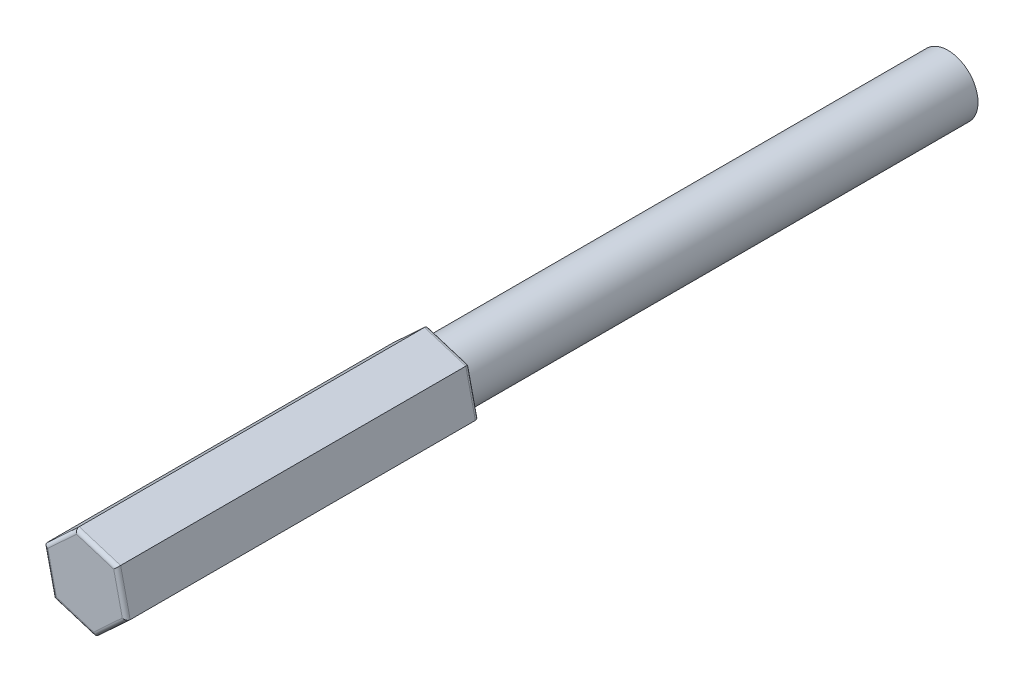
ISO-10303-21;
HEADER;
FILE_DESCRIPTION(('STEP AP214'),'2;1');
FILE_NAME('part.step','',(''),(''),'','','');
FILE_SCHEMA(('AUTOMOTIVE_DESIGN { 1 0 10303 214 1 1 1 1 }'));
ENDSEC;
DATA;
#1=APPLICATION_CONTEXT('core data for automotive mechanical design processes');
#2=APPLICATION_PROTOCOL_DEFINITION('international standard','automotive_design',2000,#1);
#3=PRODUCT_CONTEXT('',#1,'mechanical');
#4=PRODUCT('Part','Part','',(#3));
#5=PRODUCT_RELATED_PRODUCT_CATEGORY('part','',(#4));
#6=PRODUCT_DEFINITION_FORMATION('','',#4);
#7=PRODUCT_DEFINITION_CONTEXT('part definition',#1,'design');
#8=PRODUCT_DEFINITION('design','',#6,#7);
#9=PRODUCT_DEFINITION_SHAPE('','',#8);
#10=(LENGTH_UNIT() NAMED_UNIT(*) SI_UNIT(.MILLI.,.METRE.));
#11=(NAMED_UNIT(*) PLANE_ANGLE_UNIT() SI_UNIT($,.RADIAN.));
#12=(NAMED_UNIT(*) SI_UNIT($,.STERADIAN.) SOLID_ANGLE_UNIT());
#13=UNCERTAINTY_MEASURE_WITH_UNIT(LENGTH_MEASURE(1.E-05),#10,'distance_accuracy_value','');
#14=(GEOMETRIC_REPRESENTATION_CONTEXT(3) GLOBAL_UNCERTAINTY_ASSIGNED_CONTEXT((#13)) GLOBAL_UNIT_ASSIGNED_CONTEXT((#10,
#11,#12)) REPRESENTATION_CONTEXT('',''));
#15=CARTESIAN_POINT('',(0.,0.,0.));
#16=DIRECTION('',(0.,0.,1.));
#17=DIRECTION('',(1.,0.,0.));
#18=AXIS2_PLACEMENT_3D('',#15,#16,#17);
#19=CARTESIAN_POINT('',(0.,0.,38.));
#20=DIRECTION('',(0.,0.,1.));
#21=DIRECTION('',(1.,0.,0.));
#22=AXIS2_PLACEMENT_3D('',#19,#20,#21);
#23=PLANE('',#22);
#24=DIRECTION('',(-0.954937695990961,0.296806328732181,0.));
#25=VECTOR('',#24,1.);
#26=CARTESIAN_POINT('',(4.09229615849332,3.44041356300578,38.));
#27=LINE('',#26,#25);
#28=CARTESIAN_POINT('',(1.33562847929482,4.29721963195933,38.));
#29=VERTEX_POINT('',#28);
#30=CARTESIAN_POINT('',(3.81662939057347,3.52609416990113,38.));
#31=VERTEX_POINT('',#30);
#32=EDGE_CURVE('E50',#29,#31,#27,.F.);
#33=ORIENTED_EDGE('',*,*,#32,.T.);
#34=DIRECTION('',(-0.220427027309416,0.975403468125644,0.));
#35=VECTOR('',#34,1.);
#36=CARTESIAN_POINT('',(5.0256336243342,-1.8238256515618,38.));
#37=LINE('',#36,#35);
#38=CARTESIAN_POINT('',(4.3893156065654,0.991921622892373,38.));
#39=VERTEX_POINT('',#38);
#40=EDGE_CURVE('E42',#31,#39,#37,.F.);
#41=ORIENTED_EDGE('',*,*,#40,.T.);
#42=CARTESIAN_POINT('',(0.,0.,38.));
#43=DIRECTION('',(0.,0.,1.));
#44=DIRECTION('',(1.,0.,0.));
#45=AXIS2_PLACEMENT_3D('',#42,#43,#44);
#46=CIRCLE('',#45,4.5);
#47=EDGE_CURVE('E216',#39,#29,#46,.T.);
#48=ORIENTED_EDGE('',*,*,#47,.T.);
#49=EDGE_LOOP('',(#33,#41,#48));
#50=FACE_BOUND('',#49,.T.);
#51=ADVANCED_FACE('F33',(#50),#23,.F.);
#52=DIRECTION('',(-0.734510668681544,-0.678597139393463,0.));
#53=VECTOR('',#52,1.);
#54=CARTESIAN_POINT('',(-0.933337465840873,5.26423921456758,38.));
#55=LINE('',#54,#53);
#56=CARTESIAN_POINT('',(-3.05368712727058,3.30529800906695,38.));
#57=VERTEX_POINT('',#56);
#58=CARTESIAN_POINT('',(-1.14537243198384,5.06834509401752,38.));
#59=VERTEX_POINT('',#58);
#60=EDGE_CURVE('E58',#57,#59,#55,.F.);
#61=ORIENTED_EDGE('',*,*,#60,.T.);
#62=DIRECTION('',(-0.954937695990961,0.296806328732181,0.));
#63=VECTOR('',#62,1.);
#64=CARTESIAN_POINT('',(4.09229615849332,3.44041356300578,38.));
#65=LINE('',#64,#63);
#66=EDGE_CURVE('E238',#59,#29,#65,.F.);
#67=ORIENTED_EDGE('',*,*,#66,.T.);
#68=CARTESIAN_POINT('',(0.,0.,38.));
#69=DIRECTION('',(0.,0.,1.));
#70=DIRECTION('',(1.,0.,0.));
#71=AXIS2_PLACEMENT_3D('',#68,#69,#70);
#72=CIRCLE('',#71,4.5);
#73=EDGE_CURVE('E214',#29,#57,#72,.T.);
#74=ORIENTED_EDGE('',*,*,#73,.T.);
#75=EDGE_LOOP('',(#61,#67,#74));
#76=FACE_BOUND('',#75,.T.);
#77=ADVANCED_FACE('F370',(#76),#23,.F.);
#78=DIRECTION('',(0.220427027309417,-0.975403468125644,0.));
#79=VECTOR('',#78,1.);
#80=CARTESIAN_POINT('',(-5.0256336243342,1.8238256515618,38.));
#81=LINE('',#80,#79);
#82=CARTESIAN_POINT('',(-4.3893156065654,-0.991921622892375,38.));
#83=VERTEX_POINT('',#82);
#84=CARTESIAN_POINT('',(-4.96200182255732,1.54225092411638,38.));
#85=VERTEX_POINT('',#84);
#86=EDGE_CURVE('E233',#83,#85,#81,.F.);
#87=ORIENTED_EDGE('',*,*,#86,.T.);
#88=DIRECTION('',(-0.734510668681544,-0.678597139393463,0.));
#89=VECTOR('',#88,1.);
#90=CARTESIAN_POINT('',(-0.933337465840873,5.26423921456758,38.));
#91=LINE('',#90,#89);
#92=EDGE_CURVE('E235',#85,#57,#91,.F.);
#93=ORIENTED_EDGE('',*,*,#92,.T.);
#94=CARTESIAN_POINT('',(0.,0.,38.));
#95=DIRECTION('',(0.,0.,1.));
#96=DIRECTION('',(1.,0.,0.));
#97=AXIS2_PLACEMENT_3D('',#94,#95,#96);
#98=CIRCLE('',#97,4.5);
#99=EDGE_CURVE('E211',#57,#83,#98,.T.);
#100=ORIENTED_EDGE('',*,*,#99,.T.);
#101=EDGE_LOOP('',(#87,#93,#100));
#102=FACE_BOUND('',#101,.T.);
#103=ADVANCED_FACE('F289',(#102),#23,.F.);
#104=DIRECTION('',(0.954937695990961,-0.296806328732181,0.));
#105=VECTOR('',#104,1.);
#106=CARTESIAN_POINT('',(-4.09229615849333,-3.44041356300578,38.));
#107=LINE('',#106,#105);
#108=CARTESIAN_POINT('',(-1.33562847929482,-4.29721963195932,38.));
#109=VERTEX_POINT('',#108);
#110=CARTESIAN_POINT('',(-3.81662939057347,-3.52609416990113,38.));
#111=VERTEX_POINT('',#110);
#112=EDGE_CURVE('E229',#109,#111,#107,.F.);
#113=ORIENTED_EDGE('',*,*,#112,.T.);
#114=DIRECTION('',(0.220427027309417,-0.975403468125644,0.));
#115=VECTOR('',#114,1.);
#116=CARTESIAN_POINT('',(-5.0256336243342,1.8238256515618,38.));
#117=LINE('',#116,#115);
#118=EDGE_CURVE('E231',#111,#83,#117,.F.);
#119=ORIENTED_EDGE('',*,*,#118,.T.);
#120=CARTESIAN_POINT('',(0.,0.,38.));
#121=DIRECTION('',(0.,0.,1.));
#122=DIRECTION('',(1.,0.,0.));
#123=AXIS2_PLACEMENT_3D('',#120,#121,#122);
#124=CIRCLE('',#123,4.5);
#125=EDGE_CURVE('E208',#83,#109,#124,.T.);
#126=ORIENTED_EDGE('',*,*,#125,.T.);
#127=EDGE_LOOP('',(#113,#119,#126));
#128=FACE_BOUND('',#127,.T.);
#129=ADVANCED_FACE('F286',(#128),#23,.F.);
#130=DIRECTION('',(0.734510668681544,0.678597139393463,0.));
#131=VECTOR('',#130,1.);
#132=CARTESIAN_POINT('',(0.933337465840874,-5.26423921456758,38.));
#133=LINE('',#132,#131);
#134=CARTESIAN_POINT('',(3.05368712727058,-3.30529800906695,38.));
#135=VERTEX_POINT('',#134);
#136=CARTESIAN_POINT('',(1.14537243198385,-5.06834509401752,38.));
#137=VERTEX_POINT('',#136);
#138=EDGE_CURVE('E225',#135,#137,#133,.F.);
#139=ORIENTED_EDGE('',*,*,#138,.T.);
#140=DIRECTION('',(0.954937695990961,-0.296806328732181,0.));
#141=VECTOR('',#140,1.);
#142=CARTESIAN_POINT('',(-4.09229615849333,-3.44041356300578,38.));
#143=LINE('',#142,#141);
#144=EDGE_CURVE('E227',#137,#109,#143,.F.);
#145=ORIENTED_EDGE('',*,*,#144,.T.);
#146=CARTESIAN_POINT('',(0.,0.,38.));
#147=DIRECTION('',(0.,0.,1.));
#148=DIRECTION('',(1.,0.,0.));
#149=AXIS2_PLACEMENT_3D('',#146,#147,#148);
#150=CIRCLE('',#149,4.5);
#151=EDGE_CURVE('E205',#109,#135,#150,.T.);
#152=ORIENTED_EDGE('',*,*,#151,.T.);
#153=EDGE_LOOP('',(#139,#145,#152));
#154=FACE_BOUND('',#153,.T.);
#155=ADVANCED_FACE('F297',(#154),#23,.F.);
#156=CARTESIAN_POINT('',(0.,0.,-30.));
#157=DIRECTION('',(0.,0.,1.));
#158=DIRECTION('',(1.,0.,0.));
#159=AXIS2_PLACEMENT_3D('',#156,#157,#158);
#160=CYLINDRICAL_SURFACE('',#159,4.);
#161=CARTESIAN_POINT('',(0.,0.,37.5));
#162=DIRECTION('',(0.,0.,1.));
#163=DIRECTION('',(1.,0.,0.));
#164=AXIS2_PLACEMENT_3D('',#161,#162,#163);
#165=CIRCLE('',#164,4.);
#166=CARTESIAN_POINT('',(4.,0.,37.5));
#167=VERTEX_POINT('',#166);
#168=EDGE_CURVE('E11',#167,#167,#165,.F.);
#169=ORIENTED_EDGE('',*,*,#168,.T.);
#170=EDGE_LOOP('',(#169));
#171=FACE_BOUND('',#170,.T.);
#172=CARTESIAN_POINT('',(0.,0.,-30.));
#173=DIRECTION('',(0.,0.,1.));
#174=DIRECTION('',(1.,0.,0.));
#175=AXIS2_PLACEMENT_3D('',#172,#173,#174);
#176=CIRCLE('',#175,4.);
#177=CARTESIAN_POINT('',(4.,0.,-30.));
#178=VERTEX_POINT('',#177);
#179=EDGE_CURVE('E168',#178,#178,#176,.T.);
#180=ORIENTED_EDGE('',*,*,#179,.T.);
#181=EDGE_LOOP('',(#180));
#182=FACE_BOUND('',#181,.T.);
#183=ADVANCED_FACE('F386',(#171,#182),#160,.T.);
#184=CARTESIAN_POINT('',(0.,0.,-30.));
#185=DIRECTION('',(0.,0.,1.));
#186=DIRECTION('',(1.,0.,0.));
#187=AXIS2_PLACEMENT_3D('',#184,#185,#186);
#188=PLANE('',#187);
#189=ORIENTED_EDGE('',*,*,#179,.F.);
#190=EDGE_LOOP('',(#189));
#191=FACE_BOUND('',#190,.T.);
#192=ADVANCED_FACE('F391',(#191),#188,.F.);
#193=CARTESIAN_POINT('',(1.27263603553761,-5.63149454890835,38.));
#194=DIRECTION('',(0.678597139393463,-0.734510668681544,0.));
#195=DIRECTION('',(0.734510668681544,0.678597139393463,0.));
#196=AXIS2_PLACEMENT_3D('',#193,#194,#195);
#197=PLANE('',#196);
#198=DIRECTION('',(0.,0.,1.));
#199=VECTOR('',#198,1.);
#200=CARTESIAN_POINT('',(5.51333535839702,-1.71361213790709,38.));
#201=LINE('',#200,#199);
#202=CARTESIAN_POINT('',(5.51333535839702,-1.71361213790709,38.5));
#203=VERTEX_POINT('',#202);
#204=CARTESIAN_POINT('',(5.51333535839702,-1.71361213790709,84.5));
#205=VERTEX_POINT('',#204);
#206=EDGE_CURVE('E253',#203,#205,#201,.T.);
#207=ORIENTED_EDGE('',*,*,#206,.T.);
#208=DIRECTION('',(0.734510668681544,0.678597139393463,0.));
#209=VECTOR('',#208,1.);
#210=CARTESIAN_POINT('',(1.27263603553761,-5.63149454890835,84.5));
#211=LINE('',#210,#209);
#212=CARTESIAN_POINT('',(1.27263603553761,-5.63149454890835,84.5));
#213=VERTEX_POINT('',#212);
#214=EDGE_CURVE('E201',#205,#213,#211,.F.);
#215=ORIENTED_EDGE('',*,*,#214,.T.);
#216=DIRECTION('',(0.,0.,1.));
#217=VECTOR('',#216,1.);
#218=CARTESIAN_POINT('',(1.27263603553761,-5.63149454890835,38.));
#219=LINE('',#218,#217);
#220=CARTESIAN_POINT('',(1.27263603553761,-5.63149454890835,38.5));
#221=VERTEX_POINT('',#220);
#222=EDGE_CURVE('E310',#221,#213,#219,.T.);
#223=ORIENTED_EDGE('',*,*,#222,.F.);
#224=DIRECTION('',(0.734510668681544,0.678597139393463,0.));
#225=VECTOR('',#224,1.);
#226=CARTESIAN_POINT('',(5.51333535839702,-1.71361213790709,38.5));
#227=LINE('',#226,#225);
#228=EDGE_CURVE('E199',#221,#203,#227,.T.);
#229=ORIENTED_EDGE('',*,*,#228,.T.);
#230=EDGE_LOOP('',(#207,#215,#223,#229));
#231=FACE_BOUND('',#230,.T.);
#232=ADVANCED_FACE('F308',(#231),#197,.T.);
#233=CARTESIAN_POINT('',(-4.24069932285942,-3.91788241100126,38.));
#234=DIRECTION('',(-0.296806328732181,-0.954937695990961,0.));
#235=DIRECTION('',(0.954937695990961,-0.296806328732181,0.));
#236=AXIS2_PLACEMENT_3D('',#233,#234,#235);
#237=PLANE('',#236);
#238=ORIENTED_EDGE('',*,*,#222,.T.);
#239=DIRECTION('',(0.954937695990961,-0.296806328732181,0.));
#240=VECTOR('',#239,1.);
#241=CARTESIAN_POINT('',(-4.24069932285942,-3.91788241100126,84.5));
#242=LINE('',#241,#240);
#243=CARTESIAN_POINT('',(-4.24069932285942,-3.91788241100126,84.5));
#244=VERTEX_POINT('',#243);
#245=EDGE_CURVE('E155',#213,#244,#242,.F.);
#246=ORIENTED_EDGE('',*,*,#245,.T.);
#247=DIRECTION('',(0.,0.,1.));
#248=VECTOR('',#247,1.);
#249=CARTESIAN_POINT('',(-4.24069932285942,-3.91788241100126,38.));
#250=LINE('',#249,#248);
#251=CARTESIAN_POINT('',(-4.24069932285942,-3.91788241100126,38.5));
#252=VERTEX_POINT('',#251);
#253=EDGE_CURVE('E343',#252,#244,#250,.T.);
#254=ORIENTED_EDGE('',*,*,#253,.F.);
#255=DIRECTION('',(0.954937695990961,-0.296806328732181,0.));
#256=VECTOR('',#255,1.);
#257=CARTESIAN_POINT('',(1.27263603553761,-5.63149454890835,38.5));
#258=LINE('',#257,#256);
#259=EDGE_CURVE('E174',#252,#221,#258,.T.);
#260=ORIENTED_EDGE('',*,*,#259,.T.);
#261=EDGE_LOOP('',(#238,#246,#254,#260));
#262=FACE_BOUND('',#261,.T.);
#263=ADVANCED_FACE('F342',(#262),#237,.T.);
#264=CARTESIAN_POINT('',(-5.51333535839702,1.71361213790709,38.));
#265=DIRECTION('',(-0.975403468125644,-0.220427027309416,0.));
#266=DIRECTION('',(0.220427027309417,-0.975403468125644,0.));
#267=AXIS2_PLACEMENT_3D('',#264,#265,#266);
#268=PLANE('',#267);
#269=ORIENTED_EDGE('',*,*,#253,.T.);
#270=DIRECTION('',(0.220427027309417,-0.975403468125644,0.));
#271=VECTOR('',#270,1.);
#272=CARTESIAN_POINT('',(-5.51333535839702,1.71361213790709,84.5));
#273=LINE('',#272,#271);
#274=CARTESIAN_POINT('',(-5.51333535839702,1.71361213790709,84.5));
#275=VERTEX_POINT('',#274);
#276=EDGE_CURVE('E184',#244,#275,#273,.F.);
#277=ORIENTED_EDGE('',*,*,#276,.T.);
#278=DIRECTION('',(0.,0.,1.));
#279=VECTOR('',#278,1.);
#280=CARTESIAN_POINT('',(-5.51333535839702,1.71361213790709,38.));
#281=LINE('',#280,#279);
#282=CARTESIAN_POINT('',(-5.51333535839702,1.71361213790709,38.5));
#283=VERTEX_POINT('',#282);
#284=EDGE_CURVE('E345',#283,#275,#281,.T.);
#285=ORIENTED_EDGE('',*,*,#284,.F.);
#286=DIRECTION('',(0.220427027309417,-0.975403468125644,0.));
#287=VECTOR('',#286,1.);
#288=CARTESIAN_POINT('',(-4.24069932285942,-3.91788241100126,38.5));
#289=LINE('',#288,#287);
#290=EDGE_CURVE('E182',#283,#252,#289,.T.);
#291=ORIENTED_EDGE('',*,*,#290,.T.);
#292=EDGE_LOOP('',(#269,#277,#285,#291));
#293=FACE_BOUND('',#292,.T.);
#294=ADVANCED_FACE('F344',(#293),#268,.T.);
#295=CARTESIAN_POINT('',(-1.2726360355376,5.63149454890835,38.));
#296=DIRECTION('',(-0.678597139393463,0.734510668681544,0.));
#297=DIRECTION('',(-0.734510668681544,-0.678597139393463,0.));
#298=AXIS2_PLACEMENT_3D('',#295,#296,#297);
#299=PLANE('',#298);
#300=ORIENTED_EDGE('',*,*,#284,.T.);
#301=DIRECTION('',(-0.734510668681544,-0.678597139393463,0.));
#302=VECTOR('',#301,1.);
#303=CARTESIAN_POINT('',(-1.2726360355376,5.63149454890835,84.5));
#304=LINE('',#303,#302);
#305=CARTESIAN_POINT('',(-1.2726360355376,5.63149454890835,84.5));
#306=VERTEX_POINT('',#305);
#307=EDGE_CURVE('E188',#275,#306,#304,.F.);
#308=ORIENTED_EDGE('',*,*,#307,.T.);
#309=DIRECTION('',(0.,0.,1.));
#310=VECTOR('',#309,1.);
#311=CARTESIAN_POINT('',(-1.2726360355376,5.63149454890835,38.));
#312=LINE('',#311,#310);
#313=CARTESIAN_POINT('',(-1.2726360355376,5.63149454890835,38.5));
#314=VERTEX_POINT('',#313);
#315=EDGE_CURVE('E318',#314,#306,#312,.T.);
#316=ORIENTED_EDGE('',*,*,#315,.F.);
#317=DIRECTION('',(-0.734510668681544,-0.678597139393463,0.));
#318=VECTOR('',#317,1.);
#319=CARTESIAN_POINT('',(-5.51333535839702,1.71361213790709,38.5));
#320=LINE('',#319,#318);
#321=EDGE_CURVE('E186',#314,#283,#320,.T.);
#322=ORIENTED_EDGE('',*,*,#321,.T.);
#323=EDGE_LOOP('',(#300,#308,#316,#322));
#324=FACE_BOUND('',#323,.T.);
#325=ADVANCED_FACE('F439',(#324),#299,.T.);
#326=CARTESIAN_POINT('',(4.24069932285941,3.91788241100126,38.));
#327=DIRECTION('',(0.296806328732181,0.954937695990961,0.));
#328=DIRECTION('',(-0.954937695990961,0.296806328732181,0.));
#329=AXIS2_PLACEMENT_3D('',#326,#327,#328);
#330=PLANE('',#329);
#331=ORIENTED_EDGE('',*,*,#315,.T.);
#332=DIRECTION('',(-0.954937695990961,0.296806328732181,0.));
#333=VECTOR('',#332,1.);
#334=CARTESIAN_POINT('',(4.24069932285941,3.91788241100126,84.5));
#335=LINE('',#334,#333);
#336=CARTESIAN_POINT('',(4.24069932285941,3.91788241100126,84.5));
#337=VERTEX_POINT('',#336);
#338=EDGE_CURVE('E192',#306,#337,#335,.F.);
#339=ORIENTED_EDGE('',*,*,#338,.T.);
#340=DIRECTION('',(0.,0.,1.));
#341=VECTOR('',#340,1.);
#342=CARTESIAN_POINT('',(4.24069932285941,3.91788241100126,38.));
#343=LINE('',#342,#341);
#344=CARTESIAN_POINT('',(4.24069932285941,3.91788241100126,38.5));
#345=VERTEX_POINT('',#344);
#346=EDGE_CURVE('E316',#345,#337,#343,.T.);
#347=ORIENTED_EDGE('',*,*,#346,.F.);
#348=DIRECTION('',(-0.954937695990961,0.296806328732181,0.));
#349=VECTOR('',#348,1.);
#350=CARTESIAN_POINT('',(-1.27263603553761,5.63149454890835,38.5));
#351=LINE('',#350,#349);
#352=EDGE_CURVE('E190',#345,#314,#351,.T.);
#353=ORIENTED_EDGE('',*,*,#352,.T.);
#354=EDGE_LOOP('',(#331,#339,#347,#353));
#355=FACE_BOUND('',#354,.T.);
#356=ADVANCED_FACE('F353',(#355),#330,.T.);
#357=CARTESIAN_POINT('',(5.51333535839702,-1.71361213790709,38.));
#358=DIRECTION('',(0.975403468125644,0.220427027309416,0.));
#359=DIRECTION('',(-0.220427027309416,0.975403468125644,0.));
#360=AXIS2_PLACEMENT_3D('',#357,#358,#359);
#361=PLANE('',#360);
#362=ORIENTED_EDGE('',*,*,#346,.T.);
#363=DIRECTION('',(-0.220427027309416,0.975403468125644,0.));
#364=VECTOR('',#363,1.);
#365=CARTESIAN_POINT('',(5.51333535839702,-1.71361213790709,84.5));
#366=LINE('',#365,#364);
#367=EDGE_CURVE('E197',#337,#205,#366,.F.);
#368=ORIENTED_EDGE('',*,*,#367,.T.);
#369=ORIENTED_EDGE('',*,*,#206,.F.);
#370=DIRECTION('',(-0.220427027309416,0.975403468125644,0.));
#371=VECTOR('',#370,1.);
#372=CARTESIAN_POINT('',(4.24069932285941,3.91788241100126,38.5));
#373=LINE('',#372,#371);
#374=EDGE_CURVE('E194',#203,#345,#373,.T.);
#375=ORIENTED_EDGE('',*,*,#374,.T.);
#376=EDGE_LOOP('',(#362,#368,#369,#375));
#377=FACE_BOUND('',#376,.T.);
#378=ADVANCED_FACE('F313',(#377),#361,.T.);
#379=DIRECTION('',(-0.220427027309416,0.975403468125644,0.));
#380=VECTOR('',#379,1.);
#381=CARTESIAN_POINT('',(5.0256336243342,-1.8238256515618,38.));
#382=LINE('',#381,#380);
#383=CARTESIAN_POINT('',(4.96200182255732,-1.54225092411638,38.));
#384=VERTEX_POINT('',#383);
#385=EDGE_CURVE('E221',#39,#384,#382,.F.);
#386=ORIENTED_EDGE('',*,*,#385,.T.);
#387=DIRECTION('',(0.734510668681544,0.678597139393463,0.));
#388=VECTOR('',#387,1.);
#389=CARTESIAN_POINT('',(0.933337465840874,-5.26423921456758,38.));
#390=LINE('',#389,#388);
#391=EDGE_CURVE('E223',#384,#135,#390,.F.);
#392=ORIENTED_EDGE('',*,*,#391,.T.);
#393=CARTESIAN_POINT('',(0.,0.,38.));
#394=DIRECTION('',(0.,0.,1.));
#395=DIRECTION('',(1.,0.,0.));
#396=AXIS2_PLACEMENT_3D('',#393,#394,#395);
#397=CIRCLE('',#396,4.5);
#398=CARTESIAN_POINT('',(4.5,0.,38.));
#399=VERTEX_POINT('',#398);
#400=EDGE_CURVE('E203',#135,#399,#397,.T.);
#401=ORIENTED_EDGE('',*,*,#400,.T.);
#402=CARTESIAN_POINT('',(0.,0.,38.));
#403=DIRECTION('',(0.,0.,1.));
#404=DIRECTION('',(1.,0.,0.));
#405=AXIS2_PLACEMENT_3D('',#402,#403,#404);
#406=CIRCLE('',#405,4.5);
#407=EDGE_CURVE('E218',#399,#39,#406,.T.);
#408=ORIENTED_EDGE('',*,*,#407,.T.);
#409=EDGE_LOOP('',(#386,#392,#401,#408));
#410=FACE_BOUND('',#409,.T.);
#411=ADVANCED_FACE('F372',(#410),#23,.F.);
#412=CARTESIAN_POINT('',(0.,0.,85.));
#413=DIRECTION('',(0.,0.,1.));
#414=DIRECTION('',(1.,0.,0.));
#415=AXIS2_PLACEMENT_3D('',#412,#413,#414);
#416=PLANE('',#415);
#417=DIRECTION('',(0.220427027309417,-0.975403468125644,0.));
#418=VECTOR('',#417,1.);
#419=CARTESIAN_POINT('',(-4.3893156065654,-0.991921622892374,85.));
#420=LINE('',#419,#418);
#421=CARTESIAN_POINT('',(-4.96200182255732,1.54225092411638,85.));
#422=VERTEX_POINT('',#421);
#423=CARTESIAN_POINT('',(-3.81662939057347,-3.52609416990113,85.));
#424=VERTEX_POINT('',#423);
#425=EDGE_CURVE('E172',#422,#424,#420,.T.);
#426=ORIENTED_EDGE('',*,*,#425,.T.);
#427=DIRECTION('',(0.954937695990961,-0.296806328732181,0.));
#428=VECTOR('',#427,1.);
#429=CARTESIAN_POINT('',(-1.33562847929482,-4.29721963195932,85.));
#430=LINE('',#429,#428);
#431=CARTESIAN_POINT('',(1.14537243198385,-5.06834509401752,85.));
#432=VERTEX_POINT('',#431);
#433=EDGE_CURVE('E153',#424,#432,#430,.T.);
#434=ORIENTED_EDGE('',*,*,#433,.T.);
#435=DIRECTION('',(0.734510668681544,0.678597139393463,0.));
#436=VECTOR('',#435,1.);
#437=CARTESIAN_POINT('',(3.05368712727058,-3.30529800906695,85.));
#438=LINE('',#437,#436);
#439=CARTESIAN_POINT('',(4.96200182255732,-1.54225092411638,85.));
#440=VERTEX_POINT('',#439);
#441=EDGE_CURVE('E161',#432,#440,#438,.T.);
#442=ORIENTED_EDGE('',*,*,#441,.T.);
#443=DIRECTION('',(-0.220427027309416,0.975403468125644,0.));
#444=VECTOR('',#443,1.);
#445=CARTESIAN_POINT('',(4.3893156065654,0.991921622892373,85.));
#446=LINE('',#445,#444);
#447=CARTESIAN_POINT('',(3.81662939057347,3.52609416990113,85.));
#448=VERTEX_POINT('',#447);
#449=EDGE_CURVE('E167',#440,#448,#446,.T.);
#450=ORIENTED_EDGE('',*,*,#449,.T.);
#451=DIRECTION('',(-0.954937695990961,0.296806328732181,0.));
#452=VECTOR('',#451,1.);
#453=CARTESIAN_POINT('',(1.33562847929481,4.29721963195932,85.));
#454=LINE('',#453,#452);
#455=CARTESIAN_POINT('',(-1.14537243198384,5.06834509401752,85.));
#456=VERTEX_POINT('',#455);
#457=EDGE_CURVE('E325',#448,#456,#454,.T.);
#458=ORIENTED_EDGE('',*,*,#457,.T.);
#459=DIRECTION('',(-0.734510668681544,-0.678597139393463,0.));
#460=VECTOR('',#459,1.);
#461=CARTESIAN_POINT('',(-3.05368712727058,3.30529800906695,85.));
#462=LINE('',#461,#460);
#463=EDGE_CURVE('E177',#456,#422,#462,.T.);
#464=ORIENTED_EDGE('',*,*,#463,.T.);
#465=EDGE_LOOP('',(#426,#434,#442,#450,#458,#464));
#466=FACE_BOUND('',#465,.T.);
#467=ADVANCED_FACE('F170',(#466),#416,.T.);
#468=CARTESIAN_POINT('',(1.33562847929481,4.29721963195932,84.5));
#469=DIRECTION('',(-0.954937695990961,0.296806328732181,0.));
#470=DIRECTION('',(-0.296806328732181,-0.954937695990961,0.));
#471=AXIS2_PLACEMENT_3D('',#468,#469,#470);
#472=CYLINDRICAL_SURFACE('',#471,0.5);
#473=CARTESIAN_POINT('',(3.81662939057347,3.52609416990113,84.5));
#474=DIRECTION('',(-0.678597139393463,0.734510668681544,0.));
#475=DIRECTION('',(0.734510668681544,0.678597139393463,0.));
#476=AXIS2_PLACEMENT_3D('',#473,#474,#475);
#477=ELLIPSE('',#476,0.577350269189626,0.5);
#478=EDGE_CURVE('E247',#337,#448,#477,.F.);
#479=ORIENTED_EDGE('',*,*,#478,.F.);
#480=ORIENTED_EDGE('',*,*,#338,.F.);
#481=CARTESIAN_POINT('',(-1.14537243198384,5.06834509401752,84.5));
#482=DIRECTION('',(-0.975403468125644,-0.220427027309416,0.));
#483=DIRECTION('',(-0.220427027309417,0.975403468125644,0.));
#484=AXIS2_PLACEMENT_3D('',#481,#482,#483);
#485=ELLIPSE('',#484,0.577350269189626,0.5);
#486=EDGE_CURVE('E250',#456,#306,#485,.T.);
#487=ORIENTED_EDGE('',*,*,#486,.F.);
#488=ORIENTED_EDGE('',*,*,#457,.F.);
#489=EDGE_LOOP('',(#479,#480,#487,#488));
#490=FACE_BOUND('',#489,.T.);
#491=ADVANCED_FACE('F358',(#490),#472,.T.);
#492=CARTESIAN_POINT('',(-3.05368712727058,3.30529800906695,84.5));
#493=DIRECTION('',(-0.734510668681544,-0.678597139393463,0.));
#494=DIRECTION('',(0.678597139393463,-0.734510668681544,0.));
#495=AXIS2_PLACEMENT_3D('',#492,#493,#494);
#496=CYLINDRICAL_SURFACE('',#495,0.5);
#497=ORIENTED_EDGE('',*,*,#486,.T.);
#498=ORIENTED_EDGE('',*,*,#307,.F.);
#499=CARTESIAN_POINT('',(-4.96200182255732,1.54225092411639,84.5));
#500=DIRECTION('',(-0.296806328732181,-0.954937695990961,0.));
#501=DIRECTION('',(-0.954937695990961,0.296806328732181,0.));
#502=AXIS2_PLACEMENT_3D('',#499,#500,#501);
#503=ELLIPSE('',#502,0.577350269189626,0.5);
#504=EDGE_CURVE('E244',#422,#275,#503,.T.);
#505=ORIENTED_EDGE('',*,*,#504,.F.);
#506=ORIENTED_EDGE('',*,*,#463,.F.);
#507=EDGE_LOOP('',(#497,#498,#505,#506));
#508=FACE_BOUND('',#507,.T.);
#509=ADVANCED_FACE('F332',(#508),#496,.T.);
#510=CARTESIAN_POINT('',(4.3893156065654,0.991921622892373,84.5));
#511=DIRECTION('',(-0.220427027309416,0.975403468125644,0.));
#512=DIRECTION('',(-0.975403468125644,-0.220427027309416,0.));
#513=AXIS2_PLACEMENT_3D('',#510,#511,#512);
#514=CYLINDRICAL_SURFACE('',#513,0.5);
#515=ORIENTED_EDGE('',*,*,#478,.T.);
#516=ORIENTED_EDGE('',*,*,#449,.F.);
#517=CARTESIAN_POINT('',(4.96200182255732,-1.54225092411638,84.5));
#518=DIRECTION('',(0.296806328732181,0.954937695990961,0.));
#519=DIRECTION('',(0.954937695990961,-0.296806328732181,0.));
#520=AXIS2_PLACEMENT_3D('',#517,#518,#519);
#521=ELLIPSE('',#520,0.577350269189626,0.5);
#522=EDGE_CURVE('E164',#205,#440,#521,.F.);
#523=ORIENTED_EDGE('',*,*,#522,.F.);
#524=ORIENTED_EDGE('',*,*,#367,.F.);
#525=EDGE_LOOP('',(#515,#516,#523,#524));
#526=FACE_BOUND('',#525,.T.);
#527=ADVANCED_FACE('F360',(#526),#514,.T.);
#528=CARTESIAN_POINT('',(-4.3893156065654,-0.991921622892374,84.5));
#529=DIRECTION('',(0.220427027309417,-0.975403468125644,0.));
#530=DIRECTION('',(0.975403468125644,0.220427027309416,0.));
#531=AXIS2_PLACEMENT_3D('',#528,#529,#530);
#532=CYLINDRICAL_SURFACE('',#531,0.5);
#533=ORIENTED_EDGE('',*,*,#504,.T.);
#534=ORIENTED_EDGE('',*,*,#276,.F.);
#535=CARTESIAN_POINT('',(-3.81662939057348,-3.52609416990113,84.5));
#536=DIRECTION('',(0.678597139393463,-0.734510668681544,0.));
#537=DIRECTION('',(-0.734510668681544,-0.678597139393463,0.));
#538=AXIS2_PLACEMENT_3D('',#535,#536,#537);
#539=ELLIPSE('',#538,0.577350269189626,0.5);
#540=EDGE_CURVE('E158',#424,#244,#539,.T.);
#541=ORIENTED_EDGE('',*,*,#540,.F.);
#542=ORIENTED_EDGE('',*,*,#425,.F.);
#543=EDGE_LOOP('',(#533,#534,#541,#542));
#544=FACE_BOUND('',#543,.T.);
#545=ADVANCED_FACE('F335',(#544),#532,.T.);
#546=CARTESIAN_POINT('',(3.05368712727058,-3.30529800906695,84.5));
#547=DIRECTION('',(0.734510668681544,0.678597139393463,0.));
#548=DIRECTION('',(-0.678597139393463,0.734510668681544,0.));
#549=AXIS2_PLACEMENT_3D('',#546,#547,#548);
#550=CYLINDRICAL_SURFACE('',#549,0.5);
#551=ORIENTED_EDGE('',*,*,#522,.T.);
#552=ORIENTED_EDGE('',*,*,#441,.F.);
#553=CARTESIAN_POINT('',(1.14537243198385,-5.06834509401752,84.5));
#554=DIRECTION('',(0.975403468125644,0.220427027309417,0.));
#555=DIRECTION('',(-0.220427027309417,0.975403468125644,0.));
#556=AXIS2_PLACEMENT_3D('',#553,#554,#555);
#557=ELLIPSE('',#556,0.577350269189626,0.5);
#558=EDGE_CURVE('E149',#213,#432,#557,.F.);
#559=ORIENTED_EDGE('',*,*,#558,.F.);
#560=ORIENTED_EDGE('',*,*,#214,.F.);
#561=EDGE_LOOP('',(#551,#552,#559,#560));
#562=FACE_BOUND('',#561,.T.);
#563=ADVANCED_FACE('F162',(#562),#550,.T.);
#564=CARTESIAN_POINT('',(-1.33562847929482,-4.29721963195932,84.5));
#565=DIRECTION('',(0.954937695990961,-0.296806328732181,0.));
#566=DIRECTION('',(0.296806328732181,0.954937695990961,0.));
#567=AXIS2_PLACEMENT_3D('',#564,#565,#566);
#568=CYLINDRICAL_SURFACE('',#567,0.5);
#569=ORIENTED_EDGE('',*,*,#540,.T.);
#570=ORIENTED_EDGE('',*,*,#245,.F.);
#571=ORIENTED_EDGE('',*,*,#558,.T.);
#572=ORIENTED_EDGE('',*,*,#433,.F.);
#573=EDGE_LOOP('',(#569,#570,#571,#572));
#574=FACE_BOUND('',#573,.T.);
#575=ADVANCED_FACE('F151',(#574),#568,.T.);
#576=CARTESIAN_POINT('',(-5.0256336243342,1.8238256515618,38.5));
#577=DIRECTION('',(-0.220427027309417,0.975403468125644,0.));
#578=DIRECTION('',(-0.975403468125644,-0.220427027309416,0.));
#579=AXIS2_PLACEMENT_3D('',#576,#577,#578);
#580=CYLINDRICAL_SURFACE('',#579,0.5);
#581=ORIENTED_EDGE('',*,*,#86,.F.);
#582=ORIENTED_EDGE('',*,*,#118,.F.);
#583=CARTESIAN_POINT('',(-3.81662939057347,-3.52609416990113,38.5));
#584=DIRECTION('',(-0.678597139393463,0.734510668681544,0.));
#585=DIRECTION('',(-0.734510668681544,-0.678597139393463,0.));
#586=AXIS2_PLACEMENT_3D('',#583,#584,#585);
#587=ELLIPSE('',#586,0.577350269189626,0.5);
#588=EDGE_CURVE('E37',#252,#111,#587,.F.);
#589=ORIENTED_EDGE('',*,*,#588,.F.);
#590=ORIENTED_EDGE('',*,*,#290,.F.);
#591=CARTESIAN_POINT('',(-4.96200182255732,1.54225092411638,38.5));
#592=DIRECTION('',(0.296806328732181,0.954937695990961,0.));
#593=DIRECTION('',(-0.954937695990961,0.296806328732181,0.));
#594=AXIS2_PLACEMENT_3D('',#591,#592,#593);
#595=ELLIPSE('',#594,0.577350269189626,0.5);
#596=EDGE_CURVE('E264',#85,#283,#595,.T.);
#597=ORIENTED_EDGE('',*,*,#596,.F.);
#598=EDGE_LOOP('',(#581,#582,#589,#590,#597));
#599=FACE_BOUND('',#598,.T.);
#600=ADVANCED_FACE('F283',(#599),#580,.T.);
#601=CARTESIAN_POINT('',(-4.09229615849333,-3.44041356300578,38.5));
#602=DIRECTION('',(-0.954937695990961,0.296806328732181,0.));
#603=DIRECTION('',(-0.296806328732181,-0.954937695990961,0.));
#604=AXIS2_PLACEMENT_3D('',#601,#602,#603);
#605=CYLINDRICAL_SURFACE('',#604,0.5);
#606=ORIENTED_EDGE('',*,*,#112,.F.);
#607=ORIENTED_EDGE('',*,*,#144,.F.);
#608=CARTESIAN_POINT('',(1.14537243198385,-5.06834509401752,38.5));
#609=DIRECTION('',(-0.975403468125644,-0.220427027309417,0.));
#610=DIRECTION('',(0.220427027309417,-0.975403468125644,0.));
#611=AXIS2_PLACEMENT_3D('',#608,#609,#610);
#612=ELLIPSE('',#611,0.577350269189626,0.5);
#613=EDGE_CURVE('E262',#221,#137,#612,.F.);
#614=ORIENTED_EDGE('',*,*,#613,.F.);
#615=ORIENTED_EDGE('',*,*,#259,.F.);
#616=ORIENTED_EDGE('',*,*,#588,.T.);
#617=EDGE_LOOP('',(#606,#607,#614,#615,#616));
#618=FACE_BOUND('',#617,.T.);
#619=ADVANCED_FACE('F275',(#618),#605,.T.);
#620=CARTESIAN_POINT('',(-0.933337465840873,5.26423921456758,38.5));
#621=DIRECTION('',(0.734510668681544,0.678597139393463,0.));
#622=DIRECTION('',(-0.678597139393463,0.734510668681544,0.));
#623=AXIS2_PLACEMENT_3D('',#620,#621,#622);
#624=CYLINDRICAL_SURFACE('',#623,0.5);
#625=ORIENTED_EDGE('',*,*,#596,.T.);
#626=ORIENTED_EDGE('',*,*,#321,.F.);
#627=CARTESIAN_POINT('',(-1.14537243198384,5.06834509401752,38.5));
#628=DIRECTION('',(0.975403468125644,0.220427027309416,0.));
#629=DIRECTION('',(-0.220427027309417,0.975403468125644,0.));
#630=AXIS2_PLACEMENT_3D('',#627,#628,#629);
#631=ELLIPSE('',#630,0.577350269189626,0.5);
#632=EDGE_CURVE('E259',#59,#314,#631,.T.);
#633=ORIENTED_EDGE('',*,*,#632,.F.);
#634=ORIENTED_EDGE('',*,*,#60,.F.);
#635=ORIENTED_EDGE('',*,*,#92,.F.);
#636=EDGE_LOOP('',(#625,#626,#633,#634,#635));
#637=FACE_BOUND('',#636,.T.);
#638=ADVANCED_FACE('F522',(#637),#624,.T.);
#639=CARTESIAN_POINT('',(0.933337465840874,-5.26423921456758,38.5));
#640=DIRECTION('',(-0.734510668681544,-0.678597139393463,0.));
#641=DIRECTION('',(0.678597139393463,-0.734510668681544,0.));
#642=AXIS2_PLACEMENT_3D('',#639,#640,#641);
#643=CYLINDRICAL_SURFACE('',#642,0.5);
#644=ORIENTED_EDGE('',*,*,#138,.F.);
#645=ORIENTED_EDGE('',*,*,#391,.F.);
#646=CARTESIAN_POINT('',(4.96200182255732,-1.54225092411638,38.5));
#647=DIRECTION('',(-0.296806328732181,-0.954937695990961,0.));
#648=DIRECTION('',(-0.954937695990961,0.296806328732181,0.));
#649=AXIS2_PLACEMENT_3D('',#646,#647,#648);
#650=ELLIPSE('',#649,0.577350269189626,0.5);
#651=EDGE_CURVE('E256',#203,#384,#650,.F.);
#652=ORIENTED_EDGE('',*,*,#651,.F.);
#653=ORIENTED_EDGE('',*,*,#228,.F.);
#654=ORIENTED_EDGE('',*,*,#613,.T.);
#655=EDGE_LOOP('',(#644,#645,#652,#653,#654));
#656=FACE_BOUND('',#655,.T.);
#657=ADVANCED_FACE('F300',(#656),#643,.T.);
#658=CARTESIAN_POINT('',(4.09229615849332,3.44041356300578,38.5));
#659=DIRECTION('',(0.954937695990961,-0.296806328732181,0.));
#660=DIRECTION('',(0.296806328732181,0.954937695990961,0.));
#661=AXIS2_PLACEMENT_3D('',#658,#659,#660);
#662=CYLINDRICAL_SURFACE('',#661,0.5);
#663=ORIENTED_EDGE('',*,*,#632,.T.);
#664=ORIENTED_EDGE('',*,*,#352,.F.);
#665=CARTESIAN_POINT('',(3.81662939057347,3.52609416990114,38.5));
#666=DIRECTION('',(0.678597139393463,-0.734510668681544,0.));
#667=DIRECTION('',(0.734510668681544,0.678597139393463,0.));
#668=AXIS2_PLACEMENT_3D('',#665,#666,#667);
#669=ELLIPSE('',#668,0.577350269189626,0.5);
#670=EDGE_CURVE('E254',#31,#345,#669,.T.);
#671=ORIENTED_EDGE('',*,*,#670,.F.);
#672=ORIENTED_EDGE('',*,*,#32,.F.);
#673=ORIENTED_EDGE('',*,*,#66,.F.);
#674=EDGE_LOOP('',(#663,#664,#671,#672,#673));
#675=FACE_BOUND('',#674,.T.);
#676=ADVANCED_FACE('F539',(#675),#662,.T.);
#677=CARTESIAN_POINT('',(5.0256336243342,-1.8238256515618,38.5));
#678=DIRECTION('',(0.220427027309416,-0.975403468125644,0.));
#679=DIRECTION('',(0.975403468125644,0.220427027309416,0.));
#680=AXIS2_PLACEMENT_3D('',#677,#678,#679);
#681=CYLINDRICAL_SURFACE('',#680,0.5);
#682=ORIENTED_EDGE('',*,*,#385,.F.);
#683=ORIENTED_EDGE('',*,*,#40,.F.);
#684=ORIENTED_EDGE('',*,*,#670,.T.);
#685=ORIENTED_EDGE('',*,*,#374,.F.);
#686=ORIENTED_EDGE('',*,*,#651,.T.);
#687=EDGE_LOOP('',(#682,#683,#684,#685,#686));
#688=FACE_BOUND('',#687,.T.);
#689=ADVANCED_FACE('F548',(#688),#681,.T.);
#690=CARTESIAN_POINT('',(0.,0.,37.5));
#691=DIRECTION('',(0.,0.,1.));
#692=DIRECTION('',(1.,0.,0.));
#693=AXIS2_PLACEMENT_3D('',#690,#691,#692);
#694=TOROIDAL_SURFACE('',#693,4.5,0.5);
#695=ORIENTED_EDGE('',*,*,#47,.F.);
#696=ORIENTED_EDGE('',*,*,#407,.F.);
#697=ORIENTED_EDGE('',*,*,#400,.F.);
#698=ORIENTED_EDGE('',*,*,#151,.F.);
#699=ORIENTED_EDGE('',*,*,#125,.F.);
#700=ORIENTED_EDGE('',*,*,#99,.F.);
#701=ORIENTED_EDGE('',*,*,#73,.F.);
#702=EDGE_LOOP('',(#695,#696,#697,#698,#699,#700,#701));
#703=FACE_BOUND('',#702,.T.);
#704=ORIENTED_EDGE('',*,*,#168,.F.);
#705=EDGE_LOOP('',(#704));
#706=FACE_BOUND('',#705,.T.);
#707=ADVANCED_FACE('F35',(#703,#706),#694,.F.);
#708=CLOSED_SHELL('',(#51,#77,#103,#129,#155,#183,#192,#232,#263,#294,#325,#356,#378,#411,#467,
#491,#509,#527,#545,#563,#575,#600,#619,#638,#657,#676,#689,#707));
#709=MANIFOLD_SOLID_BREP('B2',#708);
#710=ADVANCED_BREP_SHAPE_REPRESENTATION('',(#18,#709),#14);
#711=SHAPE_DEFINITION_REPRESENTATION(#9,#710);
ENDSEC;
END-ISO-10303-21;
